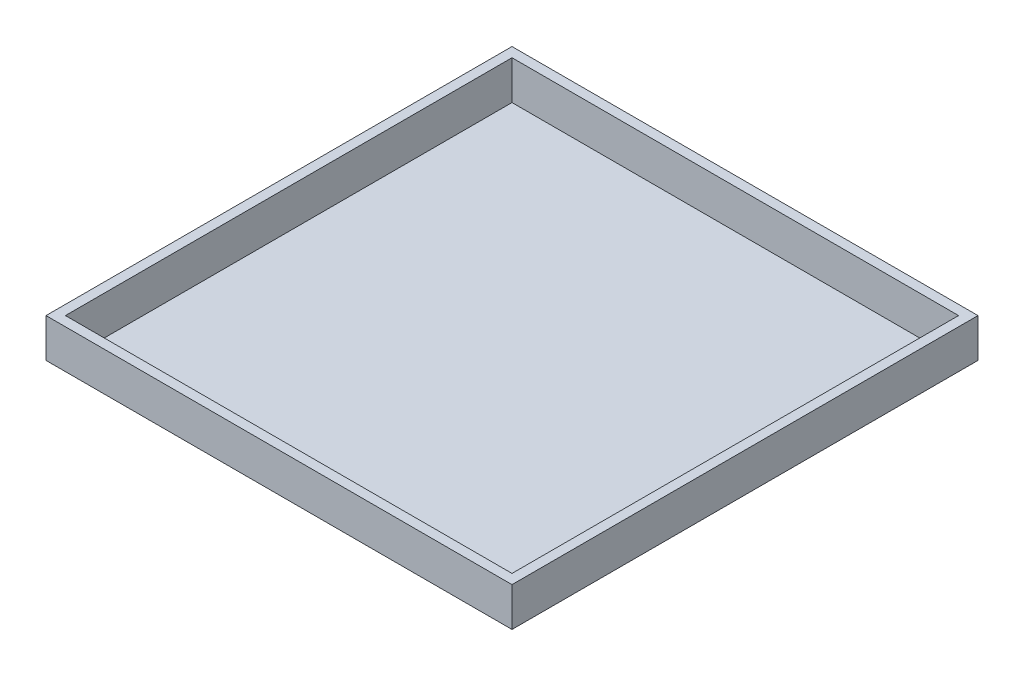
ISO-10303-21;
HEADER;
FILE_DESCRIPTION(('STEP AP214'),'2;1');
FILE_NAME('part.step','',(''),(''),'','','');
FILE_SCHEMA(('AUTOMOTIVE_DESIGN { 1 0 10303 214 1 1 1 1 }'));
ENDSEC;
DATA;
#1=APPLICATION_CONTEXT('core data for automotive mechanical design processes');
#2=APPLICATION_PROTOCOL_DEFINITION('international standard','automotive_design',2000,#1);
#3=PRODUCT_CONTEXT('',#1,'mechanical');
#4=PRODUCT('Part','Part','',(#3));
#5=PRODUCT_RELATED_PRODUCT_CATEGORY('part','',(#4));
#6=PRODUCT_DEFINITION_FORMATION('','',#4);
#7=PRODUCT_DEFINITION_CONTEXT('part definition',#1,'design');
#8=PRODUCT_DEFINITION('design','',#6,#7);
#9=PRODUCT_DEFINITION_SHAPE('','',#8);
#10=(LENGTH_UNIT() NAMED_UNIT(*) SI_UNIT(.MILLI.,.METRE.));
#11=(NAMED_UNIT(*) PLANE_ANGLE_UNIT() SI_UNIT($,.RADIAN.));
#12=(NAMED_UNIT(*) SI_UNIT($,.STERADIAN.) SOLID_ANGLE_UNIT());
#13=UNCERTAINTY_MEASURE_WITH_UNIT(LENGTH_MEASURE(1.E-05),#10,'distance_accuracy_value','');
#14=(GEOMETRIC_REPRESENTATION_CONTEXT(3) GLOBAL_UNCERTAINTY_ASSIGNED_CONTEXT((#13)) GLOBAL_UNIT_ASSIGNED_CONTEXT((#10,
#11,#12)) REPRESENTATION_CONTEXT('',''));
#15=CARTESIAN_POINT('',(0.,0.,0.));
#16=DIRECTION('',(0.,0.,1.));
#17=DIRECTION('',(1.,0.,0.));
#18=AXIS2_PLACEMENT_3D('',#15,#16,#17);
#19=CARTESIAN_POINT('',(0.,200.1,0.));
#20=DIRECTION('',(0.,1.,0.));
#21=DIRECTION('',(0.,0.,1.));
#22=AXIS2_PLACEMENT_3D('',#19,#20,#21);
#23=PLANE('',#22);
#24=DIRECTION('',(0.,0.,1.));
#25=VECTOR('',#24,1.);
#26=CARTESIAN_POINT('',(0.,200.1,-2400.));
#27=LINE('',#26,#25);
#28=CARTESIAN_POINT('',(0.,200.1,-2400.));
#29=VERTEX_POINT('',#28);
#30=CARTESIAN_POINT('',(0.,200.1,0.));
#31=VERTEX_POINT('',#30);
#32=EDGE_CURVE('E145',#29,#31,#27,.T.);
#33=ORIENTED_EDGE('',*,*,#32,.T.);
#34=DIRECTION('',(1.,0.,0.));
#35=VECTOR('',#34,1.);
#36=CARTESIAN_POINT('',(0.,200.1,0.));
#37=LINE('',#36,#35);
#38=CARTESIAN_POINT('',(2400.,200.1,0.));
#39=VERTEX_POINT('',#38);
#40=EDGE_CURVE('E148',#31,#39,#37,.T.);
#41=ORIENTED_EDGE('',*,*,#40,.T.);
#42=DIRECTION('',(0.,0.,-1.));
#43=VECTOR('',#42,1.);
#44=CARTESIAN_POINT('',(2400.,200.1,-2400.));
#45=LINE('',#44,#43);
#46=CARTESIAN_POINT('',(2400.,200.1,-2400.));
#47=VERTEX_POINT('',#46);
#48=EDGE_CURVE('E151',#39,#47,#45,.T.);
#49=ORIENTED_EDGE('',*,*,#48,.T.);
#50=DIRECTION('',(-1.,0.,0.));
#51=VECTOR('',#50,1.);
#52=CARTESIAN_POINT('',(0.,200.1,-2400.));
#53=LINE('',#52,#51);
#54=EDGE_CURVE('E153',#47,#29,#53,.T.);
#55=ORIENTED_EDGE('',*,*,#54,.T.);
#56=EDGE_LOOP('',(#33,#41,#49,#55));
#57=FACE_BOUND('',#56,.T.);
#58=DIRECTION('',(0.,0.,1.));
#59=VECTOR('',#58,1.);
#60=CARTESIAN_POINT('',(50.,200.1,-2350.));
#61=LINE('',#60,#59);
#62=CARTESIAN_POINT('',(50.,200.1,-2350.));
#63=VERTEX_POINT('',#62);
#64=CARTESIAN_POINT('',(50.,200.1,-50.));
#65=VERTEX_POINT('',#64);
#66=EDGE_CURVE('E117',#63,#65,#61,.T.);
#67=ORIENTED_EDGE('',*,*,#66,.F.);
#68=DIRECTION('',(-1.,0.,0.));
#69=VECTOR('',#68,1.);
#70=CARTESIAN_POINT('',(50.,200.1,-2350.));
#71=LINE('',#70,#69);
#72=CARTESIAN_POINT('',(2350.,200.1,-2350.));
#73=VERTEX_POINT('',#72);
#74=EDGE_CURVE('E109',#73,#63,#71,.T.);
#75=ORIENTED_EDGE('',*,*,#74,.F.);
#76=DIRECTION('',(0.,0.,-1.));
#77=VECTOR('',#76,1.);
#78=CARTESIAN_POINT('',(2350.,200.1,-2350.));
#79=LINE('',#78,#77);
#80=CARTESIAN_POINT('',(2350.,200.1,-49.9999999999998));
#81=VERTEX_POINT('',#80);
#82=EDGE_CURVE('E131',#81,#73,#79,.T.);
#83=ORIENTED_EDGE('',*,*,#82,.F.);
#84=DIRECTION('',(1.,0.,0.));
#85=VECTOR('',#84,1.);
#86=CARTESIAN_POINT('',(50.,200.1,-50.));
#87=LINE('',#86,#85);
#88=EDGE_CURVE('E129',#65,#81,#87,.T.);
#89=ORIENTED_EDGE('',*,*,#88,.F.);
#90=EDGE_LOOP('',(#67,#75,#83,#89));
#91=FACE_BOUND('',#90,.T.);
#92=ADVANCED_FACE('F44',(#57,#91),#23,.T.);
#93=CARTESIAN_POINT('',(0.,0.1,0.));
#94=DIRECTION('',(0.,1.,0.));
#95=DIRECTION('',(0.,0.,1.));
#96=AXIS2_PLACEMENT_3D('',#93,#94,#95);
#97=PLANE('',#96);
#98=DIRECTION('',(0.,0.,1.));
#99=VECTOR('',#98,1.);
#100=CARTESIAN_POINT('',(0.,0.1,-2400.));
#101=LINE('',#100,#99);
#102=CARTESIAN_POINT('',(0.,0.1,-2400.));
#103=VERTEX_POINT('',#102);
#104=CARTESIAN_POINT('',(0.,0.1,0.));
#105=VERTEX_POINT('',#104);
#106=EDGE_CURVE('E125',#103,#105,#101,.T.);
#107=ORIENTED_EDGE('',*,*,#106,.F.);
#108=DIRECTION('',(-1.,0.,0.));
#109=VECTOR('',#108,1.);
#110=CARTESIAN_POINT('',(0.,0.1,-2400.));
#111=LINE('',#110,#109);
#112=CARTESIAN_POINT('',(2400.,0.1,-2400.));
#113=VERTEX_POINT('',#112);
#114=EDGE_CURVE('E149',#113,#103,#111,.T.);
#115=ORIENTED_EDGE('',*,*,#114,.F.);
#116=DIRECTION('',(0.,0.,-1.));
#117=VECTOR('',#116,1.);
#118=CARTESIAN_POINT('',(2400.,0.1,-2400.));
#119=LINE('',#118,#117);
#120=CARTESIAN_POINT('',(2400.,0.1,0.));
#121=VERTEX_POINT('',#120);
#122=EDGE_CURVE('E160',#121,#113,#119,.T.);
#123=ORIENTED_EDGE('',*,*,#122,.F.);
#124=DIRECTION('',(1.,0.,0.));
#125=VECTOR('',#124,1.);
#126=CARTESIAN_POINT('',(0.,0.1,0.));
#127=LINE('',#126,#125);
#128=EDGE_CURVE('E158',#105,#121,#127,.T.);
#129=ORIENTED_EDGE('',*,*,#128,.F.);
#130=EDGE_LOOP('',(#107,#115,#123,#129));
#131=FACE_BOUND('',#130,.T.);
#132=DIRECTION('',(-1.,0.,0.));
#133=VECTOR('',#132,1.);
#134=CARTESIAN_POINT('',(50.,0.1,-2350.));
#135=LINE('',#134,#133);
#136=CARTESIAN_POINT('',(2350.,0.1,-2350.));
#137=VERTEX_POINT('',#136);
#138=CARTESIAN_POINT('',(50.,0.1,-2350.));
#139=VERTEX_POINT('',#138);
#140=EDGE_CURVE('E67',#137,#139,#135,.T.);
#141=ORIENTED_EDGE('',*,*,#140,.T.);
#142=DIRECTION('',(0.,0.,1.));
#143=VECTOR('',#142,1.);
#144=CARTESIAN_POINT('',(50.,0.1,-2350.));
#145=LINE('',#144,#143);
#146=CARTESIAN_POINT('',(50.,0.1,-50.));
#147=VERTEX_POINT('',#146);
#148=EDGE_CURVE('E124',#139,#147,#145,.T.);
#149=ORIENTED_EDGE('',*,*,#148,.T.);
#150=DIRECTION('',(1.,0.,0.));
#151=VECTOR('',#150,1.);
#152=CARTESIAN_POINT('',(50.,0.1,-50.));
#153=LINE('',#152,#151);
#154=CARTESIAN_POINT('',(2350.,0.1,-49.9999999999998));
#155=VERTEX_POINT('',#154);
#156=EDGE_CURVE('E137',#147,#155,#153,.T.);
#157=ORIENTED_EDGE('',*,*,#156,.T.);
#158=DIRECTION('',(0.,0.,-1.));
#159=VECTOR('',#158,1.);
#160=CARTESIAN_POINT('',(2350.,0.1,-2350.));
#161=LINE('',#160,#159);
#162=EDGE_CURVE('E118',#155,#137,#161,.T.);
#163=ORIENTED_EDGE('',*,*,#162,.T.);
#164=EDGE_LOOP('',(#141,#149,#157,#163));
#165=FACE_BOUND('',#164,.T.);
#166=ADVANCED_FACE('F178',(#131,#165),#97,.F.);
#167=CARTESIAN_POINT('',(0.,200.1,-2400.));
#168=DIRECTION('',(1.,0.,0.));
#169=DIRECTION('',(0.,0.,-1.));
#170=AXIS2_PLACEMENT_3D('',#167,#168,#169);
#171=PLANE('',#170);
#172=ORIENTED_EDGE('',*,*,#106,.T.);
#173=DIRECTION('',(0.,-1.,0.));
#174=VECTOR('',#173,1.);
#175=CARTESIAN_POINT('',(0.,200.1,0.));
#176=LINE('',#175,#174);
#177=EDGE_CURVE('E12',#31,#105,#176,.T.);
#178=ORIENTED_EDGE('',*,*,#177,.F.);
#179=ORIENTED_EDGE('',*,*,#32,.F.);
#180=DIRECTION('',(0.,-1.,0.));
#181=VECTOR('',#180,1.);
#182=CARTESIAN_POINT('',(0.,200.1,-2400.));
#183=LINE('',#182,#181);
#184=EDGE_CURVE('E155',#29,#103,#183,.T.);
#185=ORIENTED_EDGE('',*,*,#184,.T.);
#186=EDGE_LOOP('',(#172,#178,#179,#185));
#187=FACE_BOUND('',#186,.T.);
#188=ADVANCED_FACE('F46',(#187),#171,.F.);
#189=CARTESIAN_POINT('',(0.,200.1,0.));
#190=DIRECTION('',(0.,0.,-1.));
#191=DIRECTION('',(-1.,0.,0.));
#192=AXIS2_PLACEMENT_3D('',#189,#190,#191);
#193=PLANE('',#192);
#194=ORIENTED_EDGE('',*,*,#128,.T.);
#195=DIRECTION('',(0.,-1.,0.));
#196=VECTOR('',#195,1.);
#197=CARTESIAN_POINT('',(2400.,200.1,0.));
#198=LINE('',#197,#196);
#199=EDGE_CURVE('E52',#39,#121,#198,.T.);
#200=ORIENTED_EDGE('',*,*,#199,.F.);
#201=ORIENTED_EDGE('',*,*,#40,.F.);
#202=ORIENTED_EDGE('',*,*,#177,.T.);
#203=EDGE_LOOP('',(#194,#200,#201,#202));
#204=FACE_BOUND('',#203,.T.);
#205=ADVANCED_FACE('F188',(#204),#193,.F.);
#206=CARTESIAN_POINT('',(2400.,200.1,-2400.));
#207=DIRECTION('',(-1.,0.,0.));
#208=DIRECTION('',(0.,0.,1.));
#209=AXIS2_PLACEMENT_3D('',#206,#207,#208);
#210=PLANE('',#209);
#211=ORIENTED_EDGE('',*,*,#122,.T.);
#212=DIRECTION('',(0.,-1.,0.));
#213=VECTOR('',#212,1.);
#214=CARTESIAN_POINT('',(2400.,200.1,-2400.));
#215=LINE('',#214,#213);
#216=EDGE_CURVE('E165',#47,#113,#215,.T.);
#217=ORIENTED_EDGE('',*,*,#216,.F.);
#218=ORIENTED_EDGE('',*,*,#48,.F.);
#219=ORIENTED_EDGE('',*,*,#199,.T.);
#220=EDGE_LOOP('',(#211,#217,#218,#219));
#221=FACE_BOUND('',#220,.T.);
#222=ADVANCED_FACE('F172',(#221),#210,.F.);
#223=CARTESIAN_POINT('',(0.,200.1,-2400.));
#224=DIRECTION('',(0.,0.,1.));
#225=DIRECTION('',(1.,0.,0.));
#226=AXIS2_PLACEMENT_3D('',#223,#224,#225);
#227=PLANE('',#226);
#228=ORIENTED_EDGE('',*,*,#114,.T.);
#229=ORIENTED_EDGE('',*,*,#184,.F.);
#230=ORIENTED_EDGE('',*,*,#54,.F.);
#231=ORIENTED_EDGE('',*,*,#216,.T.);
#232=EDGE_LOOP('',(#228,#229,#230,#231));
#233=FACE_BOUND('',#232,.T.);
#234=ADVANCED_FACE('F182',(#233),#227,.F.);
#235=CARTESIAN_POINT('',(50.,200.1,-2350.));
#236=DIRECTION('',(0.,0.,1.));
#237=DIRECTION('',(1.,0.,0.));
#238=AXIS2_PLACEMENT_3D('',#235,#236,#237);
#239=PLANE('',#238);
#240=ORIENTED_EDGE('',*,*,#140,.F.);
#241=DIRECTION('',(0.,-1.,0.));
#242=VECTOR('',#241,1.);
#243=CARTESIAN_POINT('',(2350.,200.1,-2350.));
#244=LINE('',#243,#242);
#245=EDGE_CURVE('E113',#73,#137,#244,.T.);
#246=ORIENTED_EDGE('',*,*,#245,.F.);
#247=ORIENTED_EDGE('',*,*,#74,.T.);
#248=DIRECTION('',(0.,-1.,0.));
#249=VECTOR('',#248,1.);
#250=CARTESIAN_POINT('',(50.,200.1,-2350.));
#251=LINE('',#250,#249);
#252=EDGE_CURVE('E112',#63,#139,#251,.T.);
#253=ORIENTED_EDGE('',*,*,#252,.T.);
#254=EDGE_LOOP('',(#240,#246,#247,#253));
#255=FACE_BOUND('',#254,.T.);
#256=ADVANCED_FACE('F111',(#255),#239,.T.);
#257=CARTESIAN_POINT('',(50.,200.1,-2350.));
#258=DIRECTION('',(1.,0.,0.));
#259=DIRECTION('',(0.,0.,-1.));
#260=AXIS2_PLACEMENT_3D('',#257,#258,#259);
#261=PLANE('',#260);
#262=ORIENTED_EDGE('',*,*,#148,.F.);
#263=ORIENTED_EDGE('',*,*,#252,.F.);
#264=ORIENTED_EDGE('',*,*,#66,.T.);
#265=DIRECTION('',(0.,-1.,0.));
#266=VECTOR('',#265,1.);
#267=CARTESIAN_POINT('',(50.,200.1,-50.));
#268=LINE('',#267,#266);
#269=EDGE_CURVE('E126',#65,#147,#268,.T.);
#270=ORIENTED_EDGE('',*,*,#269,.T.);
#271=EDGE_LOOP('',(#262,#263,#264,#270));
#272=FACE_BOUND('',#271,.T.);
#273=ADVANCED_FACE('F121',(#272),#261,.T.);
#274=CARTESIAN_POINT('',(50.,200.1,-50.));
#275=DIRECTION('',(0.,0.,-1.));
#276=DIRECTION('',(-1.,0.,0.));
#277=AXIS2_PLACEMENT_3D('',#274,#275,#276);
#278=PLANE('',#277);
#279=ORIENTED_EDGE('',*,*,#156,.F.);
#280=ORIENTED_EDGE('',*,*,#269,.F.);
#281=ORIENTED_EDGE('',*,*,#88,.T.);
#282=DIRECTION('',(0.,-1.,0.));
#283=VECTOR('',#282,1.);
#284=CARTESIAN_POINT('',(2350.,200.1,-49.9999999999998));
#285=LINE('',#284,#283);
#286=EDGE_CURVE('E59',#81,#155,#285,.T.);
#287=ORIENTED_EDGE('',*,*,#286,.T.);
#288=EDGE_LOOP('',(#279,#280,#281,#287));
#289=FACE_BOUND('',#288,.T.);
#290=ADVANCED_FACE('F211',(#289),#278,.T.);
#291=CARTESIAN_POINT('',(2350.,200.1,-2350.));
#292=DIRECTION('',(-1.,0.,0.));
#293=DIRECTION('',(0.,0.,1.));
#294=AXIS2_PLACEMENT_3D('',#291,#292,#293);
#295=PLANE('',#294);
#296=ORIENTED_EDGE('',*,*,#162,.F.);
#297=ORIENTED_EDGE('',*,*,#286,.F.);
#298=ORIENTED_EDGE('',*,*,#82,.T.);
#299=ORIENTED_EDGE('',*,*,#245,.T.);
#300=EDGE_LOOP('',(#296,#297,#298,#299));
#301=FACE_BOUND('',#300,.T.);
#302=ADVANCED_FACE('F215',(#301),#295,.T.);
#303=CLOSED_SHELL('',(#92,#166,#188,#205,#222,#234,#256,#273,#290,#302));
#304=MANIFOLD_SOLID_BREP('B2',#303);
#305=CARTESIAN_POINT('',(0.,0.1,0.));
#306=DIRECTION('',(0.,0.,-1.));
#307=DIRECTION('',(-1.,0.,0.));
#308=AXIS2_PLACEMENT_3D('',#305,#306,#307);
#309=PLANE('',#308);
#310=DIRECTION('',(1.,0.,0.));
#311=VECTOR('',#310,1.);
#312=CARTESIAN_POINT('',(0.,0.,0.));
#313=LINE('',#312,#311);
#314=CARTESIAN_POINT('',(0.,0.,0.));
#315=VERTEX_POINT('',#314);
#316=CARTESIAN_POINT('',(2400.,0.,0.));
#317=VERTEX_POINT('',#316);
#318=EDGE_CURVE('E336',#315,#317,#313,.T.);
#319=ORIENTED_EDGE('',*,*,#318,.T.);
#320=DIRECTION('',(0.,-1.,0.));
#321=VECTOR('',#320,1.);
#322=CARTESIAN_POINT('',(2400.,0.1,0.));
#323=LINE('',#322,#321);
#324=CARTESIAN_POINT('',(2400.,0.1,0.));
#325=VERTEX_POINT('',#324);
#326=EDGE_CURVE('E42',#325,#317,#323,.T.);
#327=ORIENTED_EDGE('',*,*,#326,.F.);
#328=DIRECTION('',(1.,0.,0.));
#329=VECTOR('',#328,1.);
#330=CARTESIAN_POINT('',(0.,0.1,0.));
#331=LINE('',#330,#329);
#332=CARTESIAN_POINT('',(0.,0.1,0.));
#333=VERTEX_POINT('',#332);
#334=EDGE_CURVE('E322',#333,#325,#331,.T.);
#335=ORIENTED_EDGE('',*,*,#334,.F.);
#336=DIRECTION('',(0.,-1.,0.));
#337=VECTOR('',#336,1.);
#338=CARTESIAN_POINT('',(0.,0.1,0.));
#339=LINE('',#338,#337);
#340=EDGE_CURVE('E289',#333,#315,#339,.T.);
#341=ORIENTED_EDGE('',*,*,#340,.T.);
#342=EDGE_LOOP('',(#319,#327,#335,#341));
#343=FACE_BOUND('',#342,.T.);
#344=ADVANCED_FACE('F273',(#343),#309,.F.);
#345=CARTESIAN_POINT('',(2400.,0.1,0.));
#346=DIRECTION('',(-1.,0.,0.));
#347=DIRECTION('',(0.,0.,1.));
#348=AXIS2_PLACEMENT_3D('',#345,#346,#347);
#349=PLANE('',#348);
#350=DIRECTION('',(0.,0.,-1.));
#351=VECTOR('',#350,1.);
#352=CARTESIAN_POINT('',(2400.,0.,0.));
#353=LINE('',#352,#351);
#354=CARTESIAN_POINT('',(2400.,0.,-2400.));
#355=VERTEX_POINT('',#354);
#356=EDGE_CURVE('E327',#317,#355,#353,.T.);
#357=ORIENTED_EDGE('',*,*,#356,.T.);
#358=DIRECTION('',(0.,-1.,0.));
#359=VECTOR('',#358,1.);
#360=CARTESIAN_POINT('',(2400.,0.1,-2400.));
#361=LINE('',#360,#359);
#362=CARTESIAN_POINT('',(2400.,0.1,-2400.));
#363=VERTEX_POINT('',#362);
#364=EDGE_CURVE('E281',#363,#355,#361,.T.);
#365=ORIENTED_EDGE('',*,*,#364,.F.);
#366=DIRECTION('',(0.,0.,-1.));
#367=VECTOR('',#366,1.);
#368=CARTESIAN_POINT('',(2400.,0.1,0.));
#369=LINE('',#368,#367);
#370=EDGE_CURVE('E314',#325,#363,#369,.T.);
#371=ORIENTED_EDGE('',*,*,#370,.F.);
#372=ORIENTED_EDGE('',*,*,#326,.T.);
#373=EDGE_LOOP('',(#357,#365,#371,#372));
#374=FACE_BOUND('',#373,.T.);
#375=ADVANCED_FACE('F326',(#374),#349,.F.);
#376=CARTESIAN_POINT('',(0.,0.1,-2400.));
#377=DIRECTION('',(0.,0.,-1.));
#378=DIRECTION('',(-1.,0.,0.));
#379=AXIS2_PLACEMENT_3D('',#376,#377,#378);
#380=PLANE('',#379);
#381=DIRECTION('',(1.,0.,0.));
#382=VECTOR('',#381,1.);
#383=CARTESIAN_POINT('',(0.,0.,-2400.));
#384=LINE('',#383,#382);
#385=CARTESIAN_POINT('',(0.,0.,-2400.));
#386=VERTEX_POINT('',#385);
#387=EDGE_CURVE('E339',#386,#355,#384,.T.);
#388=ORIENTED_EDGE('',*,*,#387,.F.);
#389=DIRECTION('',(0.,-1.,0.));
#390=VECTOR('',#389,1.);
#391=CARTESIAN_POINT('',(0.,0.1,-2400.));
#392=LINE('',#391,#390);
#393=CARTESIAN_POINT('',(0.,0.1,-2400.));
#394=VERTEX_POINT('',#393);
#395=EDGE_CURVE('E303',#394,#386,#392,.T.);
#396=ORIENTED_EDGE('',*,*,#395,.F.);
#397=DIRECTION('',(1.,0.,0.));
#398=VECTOR('',#397,1.);
#399=CARTESIAN_POINT('',(0.,0.1,-2400.));
#400=LINE('',#399,#398);
#401=EDGE_CURVE('E321',#394,#363,#400,.T.);
#402=ORIENTED_EDGE('',*,*,#401,.T.);
#403=ORIENTED_EDGE('',*,*,#364,.T.);
#404=EDGE_LOOP('',(#388,#396,#402,#403));
#405=FACE_BOUND('',#404,.T.);
#406=ADVANCED_FACE('F330',(#405),#380,.T.);
#407=CARTESIAN_POINT('',(0.,0.1,0.));
#408=DIRECTION('',(-1.,0.,0.));
#409=DIRECTION('',(0.,0.,1.));
#410=AXIS2_PLACEMENT_3D('',#407,#408,#409);
#411=PLANE('',#410);
#412=DIRECTION('',(0.,0.,-1.));
#413=VECTOR('',#412,1.);
#414=CARTESIAN_POINT('',(0.,0.,0.));
#415=LINE('',#414,#413);
#416=EDGE_CURVE('E341',#315,#386,#415,.T.);
#417=ORIENTED_EDGE('',*,*,#416,.F.);
#418=ORIENTED_EDGE('',*,*,#340,.F.);
#419=DIRECTION('',(0.,0.,-1.));
#420=VECTOR('',#419,1.);
#421=CARTESIAN_POINT('',(0.,0.1,0.));
#422=LINE('',#421,#420);
#423=EDGE_CURVE('E331',#333,#394,#422,.T.);
#424=ORIENTED_EDGE('',*,*,#423,.T.);
#425=ORIENTED_EDGE('',*,*,#395,.T.);
#426=EDGE_LOOP('',(#417,#418,#424,#425));
#427=FACE_BOUND('',#426,.T.);
#428=ADVANCED_FACE('F347',(#427),#411,.T.);
#429=CARTESIAN_POINT('',(0.,0.1,0.));
#430=DIRECTION('',(0.,1.,0.));
#431=DIRECTION('',(0.,0.,1.));
#432=AXIS2_PLACEMENT_3D('',#429,#430,#431);
#433=PLANE('',#432);
#434=ORIENTED_EDGE('',*,*,#334,.T.);
#435=ORIENTED_EDGE('',*,*,#370,.T.);
#436=ORIENTED_EDGE('',*,*,#401,.F.);
#437=ORIENTED_EDGE('',*,*,#423,.F.);
#438=EDGE_LOOP('',(#434,#435,#436,#437));
#439=FACE_BOUND('',#438,.T.);
#440=ADVANCED_FACE('F318',(#439),#433,.T.);
#441=CARTESIAN_POINT('',(0.,0.,0.));
#442=DIRECTION('',(0.,1.,0.));
#443=DIRECTION('',(0.,0.,1.));
#444=AXIS2_PLACEMENT_3D('',#441,#442,#443);
#445=PLANE('',#444);
#446=ORIENTED_EDGE('',*,*,#318,.F.);
#447=ORIENTED_EDGE('',*,*,#416,.T.);
#448=ORIENTED_EDGE('',*,*,#387,.T.);
#449=ORIENTED_EDGE('',*,*,#356,.F.);
#450=EDGE_LOOP('',(#446,#447,#448,#449));
#451=FACE_BOUND('',#450,.T.);
#452=ADVANCED_FACE('F346',(#451),#445,.F.);
#453=CLOSED_SHELL('',(#344,#375,#406,#428,#440,#452));
#454=MANIFOLD_SOLID_BREP('B6',#453);
#455=ADVANCED_BREP_SHAPE_REPRESENTATION('',(#18,#304,#454),#14);
#456=SHAPE_DEFINITION_REPRESENTATION(#9,#455);
ENDSEC;
END-ISO-10303-21;
